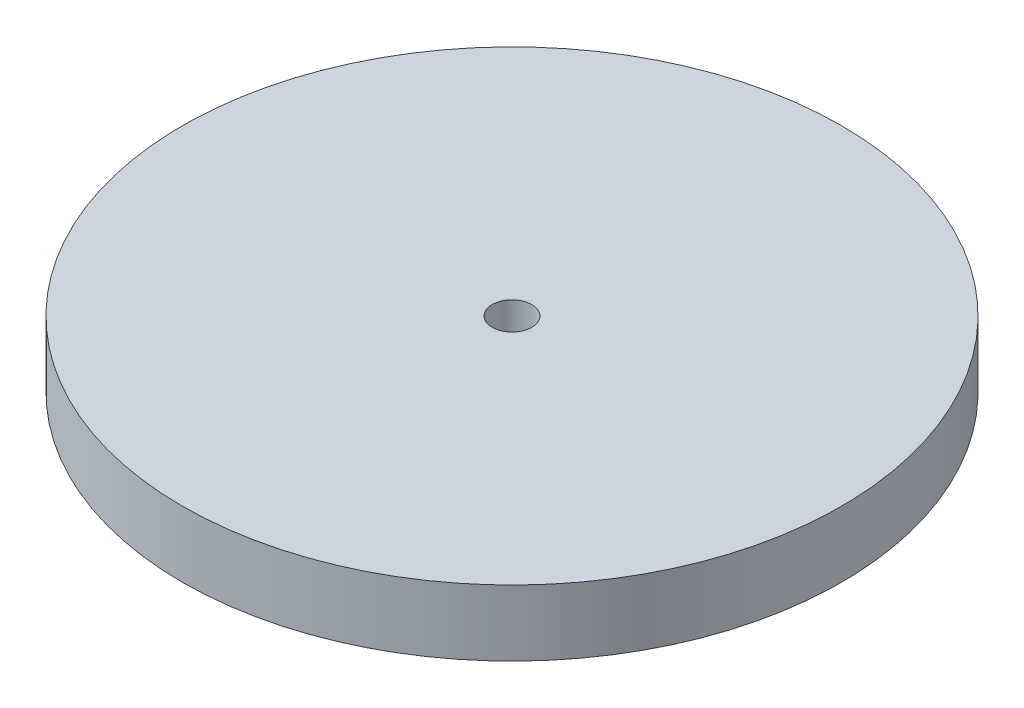
ISO-10303-21;
HEADER;
FILE_DESCRIPTION(('STEP AP214'),'2;1');
FILE_NAME('part.step','',(''),(''),'','','');
FILE_SCHEMA(('AUTOMOTIVE_DESIGN { 1 0 10303 214 1 1 1 1 }'));
ENDSEC;
DATA;
#1=APPLICATION_CONTEXT('core data for automotive mechanical design processes');
#2=APPLICATION_PROTOCOL_DEFINITION('international standard','automotive_design',2000,#1);
#3=PRODUCT_CONTEXT('',#1,'mechanical');
#4=PRODUCT('Part','Part','',(#3));
#5=PRODUCT_RELATED_PRODUCT_CATEGORY('part','',(#4));
#6=PRODUCT_DEFINITION_FORMATION('','',#4);
#7=PRODUCT_DEFINITION_CONTEXT('part definition',#1,'design');
#8=PRODUCT_DEFINITION('design','',#6,#7);
#9=PRODUCT_DEFINITION_SHAPE('','',#8);
#10=(LENGTH_UNIT() NAMED_UNIT(*) SI_UNIT(.MILLI.,.METRE.));
#11=(NAMED_UNIT(*) PLANE_ANGLE_UNIT() SI_UNIT($,.RADIAN.));
#12=(NAMED_UNIT(*) SI_UNIT($,.STERADIAN.) SOLID_ANGLE_UNIT());
#13=UNCERTAINTY_MEASURE_WITH_UNIT(LENGTH_MEASURE(1.E-05),#10,'distance_accuracy_value','');
#14=(GEOMETRIC_REPRESENTATION_CONTEXT(3) GLOBAL_UNCERTAINTY_ASSIGNED_CONTEXT((#13)) GLOBAL_UNIT_ASSIGNED_CONTEXT((#10,
#11,#12)) REPRESENTATION_CONTEXT('',''));
#15=CARTESIAN_POINT('',(0.,0.,0.));
#16=DIRECTION('',(0.,0.,1.));
#17=DIRECTION('',(1.,0.,0.));
#18=AXIS2_PLACEMENT_3D('',#15,#16,#17);
#19=CARTESIAN_POINT('',(0.,10.,0.));
#20=DIRECTION('',(0.,1.,0.));
#21=DIRECTION('',(0.,0.,1.));
#22=AXIS2_PLACEMENT_3D('',#19,#20,#21);
#23=PLANE('',#22);
#24=CARTESIAN_POINT('',(0.,10.,0.));
#25=DIRECTION('',(0.,1.,0.));
#26=DIRECTION('',(0.,0.,1.));
#27=AXIS2_PLACEMENT_3D('',#24,#25,#26);
#28=CIRCLE('',#27,50.);
#29=CARTESIAN_POINT('',(0.,10.,50.));
#30=VERTEX_POINT('',#29);
#31=EDGE_CURVE('E10',#30,#30,#28,.T.);
#32=ORIENTED_EDGE('',*,*,#31,.T.);
#33=EDGE_LOOP('',(#32));
#34=FACE_BOUND('',#33,.T.);
#35=CARTESIAN_POINT('',(0.,10.,0.));
#36=DIRECTION('',(0.,1.,0.));
#37=DIRECTION('',(0.,0.,1.));
#38=AXIS2_PLACEMENT_3D('',#35,#36,#37);
#39=CIRCLE('',#38,3.);
#40=CARTESIAN_POINT('',(0.,10.,3.));
#41=VERTEX_POINT('',#40);
#42=EDGE_CURVE('E42',#41,#41,#39,.T.);
#43=ORIENTED_EDGE('',*,*,#42,.F.);
#44=EDGE_LOOP('',(#43));
#45=FACE_BOUND('',#44,.T.);
#46=ADVANCED_FACE('F31',(#34,#45),#23,.T.);
#47=CARTESIAN_POINT('',(0.,0.,0.));
#48=DIRECTION('',(0.,1.,0.));
#49=DIRECTION('',(0.,0.,1.));
#50=AXIS2_PLACEMENT_3D('',#47,#48,#49);
#51=PLANE('',#50);
#52=CARTESIAN_POINT('',(0.,0.,0.));
#53=DIRECTION('',(0.,1.,0.));
#54=DIRECTION('',(0.,0.,1.));
#55=AXIS2_PLACEMENT_3D('',#52,#53,#54);
#56=CIRCLE('',#55,50.);
#57=CARTESIAN_POINT('',(0.,0.,50.));
#58=VERTEX_POINT('',#57);
#59=EDGE_CURVE('E35',#58,#58,#56,.T.);
#60=ORIENTED_EDGE('',*,*,#59,.F.);
#61=EDGE_LOOP('',(#60));
#62=FACE_BOUND('',#61,.T.);
#63=CARTESIAN_POINT('',(0.,0.,0.));
#64=DIRECTION('',(0.,1.,0.));
#65=DIRECTION('',(0.,0.,1.));
#66=AXIS2_PLACEMENT_3D('',#63,#64,#65);
#67=CIRCLE('',#66,3.);
#68=CARTESIAN_POINT('',(0.,0.,3.));
#69=VERTEX_POINT('',#68);
#70=EDGE_CURVE('E44',#69,#69,#67,.T.);
#71=ORIENTED_EDGE('',*,*,#70,.T.);
#72=EDGE_LOOP('',(#71));
#73=FACE_BOUND('',#72,.T.);
#74=ADVANCED_FACE('F54',(#62,#73),#51,.F.);
#75=CARTESIAN_POINT('',(0.,10.,0.));
#76=DIRECTION('',(0.,-1.,0.));
#77=DIRECTION('',(0.,0.,-1.));
#78=AXIS2_PLACEMENT_3D('',#75,#76,#77);
#79=CYLINDRICAL_SURFACE('',#78,50.);
#80=ORIENTED_EDGE('',*,*,#31,.F.);
#81=EDGE_LOOP('',(#80));
#82=FACE_BOUND('',#81,.T.);
#83=ORIENTED_EDGE('',*,*,#59,.T.);
#84=EDGE_LOOP('',(#83));
#85=FACE_BOUND('',#84,.T.);
#86=ADVANCED_FACE('F33',(#82,#85),#79,.T.);
#87=CARTESIAN_POINT('',(0.,10.,0.));
#88=DIRECTION('',(0.,-1.,0.));
#89=DIRECTION('',(0.,0.,-1.));
#90=AXIS2_PLACEMENT_3D('',#87,#88,#89);
#91=CYLINDRICAL_SURFACE('',#90,3.);
#92=ORIENTED_EDGE('',*,*,#42,.T.);
#93=EDGE_LOOP('',(#92));
#94=FACE_BOUND('',#93,.T.);
#95=ORIENTED_EDGE('',*,*,#70,.F.);
#96=EDGE_LOOP('',(#95));
#97=FACE_BOUND('',#96,.T.);
#98=ADVANCED_FACE('F50',(#94,#97),#91,.F.);
#99=CLOSED_SHELL('',(#46,#74,#86,#98));
#100=MANIFOLD_SOLID_BREP('B2',#99);
#101=ADVANCED_BREP_SHAPE_REPRESENTATION('',(#18,#100),#14);
#102=SHAPE_DEFINITION_REPRESENTATION(#9,#101);
ENDSEC;
END-ISO-10303-21;
